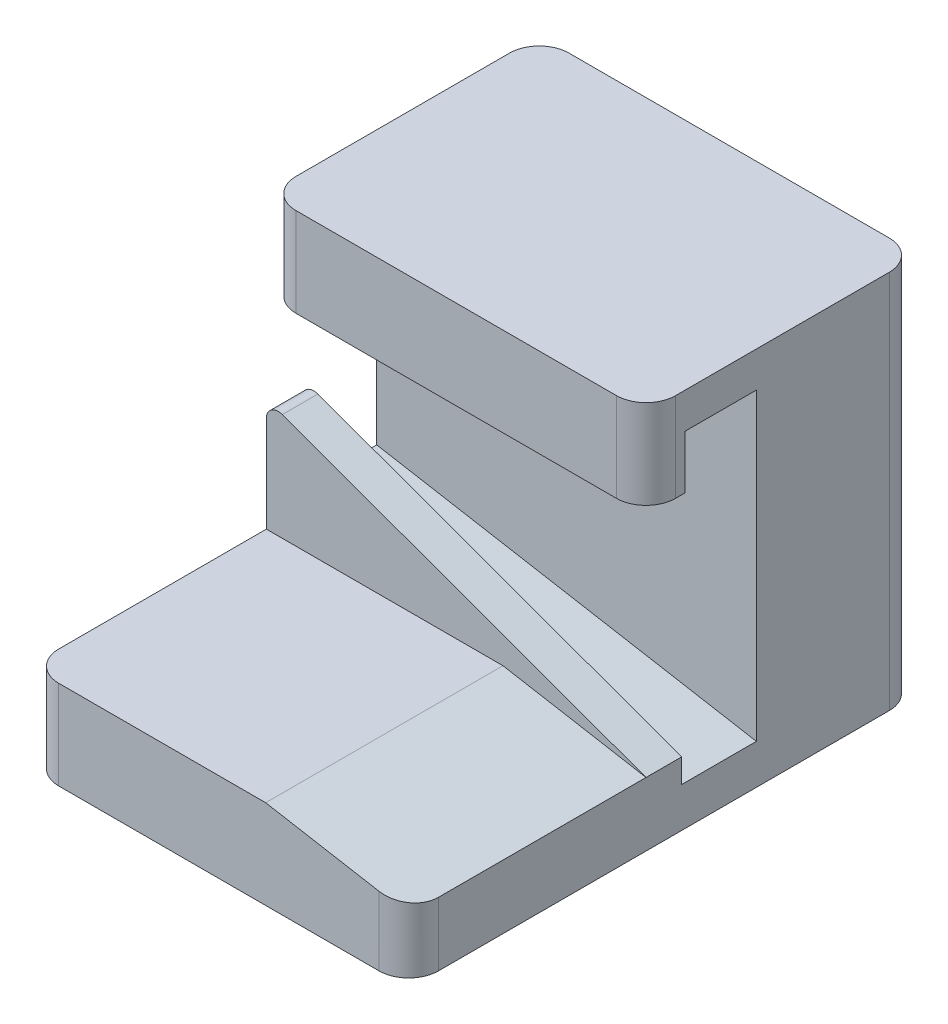
ISO-10303-21;
HEADER;
FILE_DESCRIPTION(('STEP AP214'),'2;1');
FILE_NAME('part.step','',(''),(''),'','','');
FILE_SCHEMA(('AUTOMOTIVE_DESIGN { 1 0 10303 214 1 1 1 1 }'));
ENDSEC;
DATA;
#1=APPLICATION_CONTEXT('core data for automotive mechanical design processes');
#2=APPLICATION_PROTOCOL_DEFINITION('international standard','automotive_design',2000,#1);
#3=PRODUCT_CONTEXT('',#1,'mechanical');
#4=PRODUCT('Part','Part','',(#3));
#5=PRODUCT_RELATED_PRODUCT_CATEGORY('part','',(#4));
#6=PRODUCT_DEFINITION_FORMATION('','',#4);
#7=PRODUCT_DEFINITION_CONTEXT('part definition',#1,'design');
#8=PRODUCT_DEFINITION('design','',#6,#7);
#9=PRODUCT_DEFINITION_SHAPE('','',#8);
#10=(LENGTH_UNIT() NAMED_UNIT(*) SI_UNIT(.MILLI.,.METRE.));
#11=(NAMED_UNIT(*) PLANE_ANGLE_UNIT() SI_UNIT($,.RADIAN.));
#12=(NAMED_UNIT(*) SI_UNIT($,.STERADIAN.) SOLID_ANGLE_UNIT());
#13=UNCERTAINTY_MEASURE_WITH_UNIT(LENGTH_MEASURE(1.E-05),#10,'distance_accuracy_value','');
#14=(GEOMETRIC_REPRESENTATION_CONTEXT(3) GLOBAL_UNCERTAINTY_ASSIGNED_CONTEXT((#13)) GLOBAL_UNIT_ASSIGNED_CONTEXT((#10,
#11,#12)) REPRESENTATION_CONTEXT('',''));
#15=CARTESIAN_POINT('',(0.,0.,0.));
#16=DIRECTION('',(0.,0.,1.));
#17=DIRECTION('',(1.,0.,0.));
#18=AXIS2_PLACEMENT_3D('',#15,#16,#17);
#19=CARTESIAN_POINT('',(-78.74,39.6048925275896,-58.42));
#20=DIRECTION('',(0.,0.,-1.));
#21=DIRECTION('',(-1.,0.,0.));
#22=AXIS2_PLACEMENT_3D('',#19,#20,#21);
#23=CYLINDRICAL_SURFACE('',#22,2.54);
#24=CARTESIAN_POINT('',(-78.74,39.6048925275896,-58.42));
#25=DIRECTION('',(0.,0.,1.));
#26=DIRECTION('',(1.,0.,0.));
#27=AXIS2_PLACEMENT_3D('',#24,#25,#26);
#28=CIRCLE('',#27,2.54);
#29=CARTESIAN_POINT('',(-81.28,39.6048925275896,-58.42));
#30=VERTEX_POINT('',#29);
#31=CARTESIAN_POINT('',(-77.8712688359528,41.9917117843858,-58.42));
#32=VERTEX_POINT('',#31);
#33=EDGE_CURVE('E286',#30,#32,#28,.F.);
#34=ORIENTED_EDGE('',*,*,#33,.F.);
#35=DIRECTION('',(0.,0.,1.));
#36=VECTOR('',#35,1.);
#37=CARTESIAN_POINT('',(-81.28,39.6048925275896,-58.42));
#38=LINE('',#37,#36);
#39=CARTESIAN_POINT('',(-81.28,39.6048925275896,-50.8));
#40=VERTEX_POINT('',#39);
#41=EDGE_CURVE('E296',#40,#30,#38,.F.);
#42=ORIENTED_EDGE('',*,*,#41,.F.);
#43=CARTESIAN_POINT('',(-78.74,39.6048925275896,-50.8));
#44=DIRECTION('',(0.,0.,-1.));
#45=DIRECTION('',(-1.,0.,0.));
#46=AXIS2_PLACEMENT_3D('',#43,#44,#45);
#47=CIRCLE('',#46,2.54);
#48=CARTESIAN_POINT('',(-77.8712688359528,41.9917117843858,-50.8));
#49=VERTEX_POINT('',#48);
#50=EDGE_CURVE('E298',#49,#40,#47,.F.);
#51=ORIENTED_EDGE('',*,*,#50,.F.);
#52=DIRECTION('',(0.,0.,1.));
#53=VECTOR('',#52,1.);
#54=CARTESIAN_POINT('',(-77.8712688359528,41.9917117843858,-58.42));
#55=LINE('',#54,#53);
#56=EDGE_CURVE('E293',#32,#49,#55,.T.);
#57=ORIENTED_EDGE('',*,*,#56,.F.);
#58=EDGE_LOOP('',(#34,#42,#51,#57));
#59=FACE_BOUND('',#58,.T.);
#60=ADVANCED_FACE('F33',(#59),#23,.T.);
#61=CARTESIAN_POINT('',(0.,0.,0.));
#62=DIRECTION('',(-1.,0.,0.));
#63=DIRECTION('',(0.,0.,1.));
#64=AXIS2_PLACEMENT_3D('',#61,#62,#63);
#65=PLANE('',#64);
#66=DIRECTION('',(0.,0.,-1.));
#67=VECTOR('',#66,1.);
#68=CARTESIAN_POINT('',(0.,0.,0.));
#69=LINE('',#68,#67);
#70=CARTESIAN_POINT('',(0.,0.,-6.35));
#71=VERTEX_POINT('',#70);
#72=CARTESIAN_POINT('',(0.,0.,-102.87));
#73=VERTEX_POINT('',#72);
#74=EDGE_CURVE('E261',#71,#73,#69,.T.);
#75=ORIENTED_EDGE('',*,*,#74,.T.);
#76=DIRECTION('',(0.,1.,0.));
#77=VECTOR('',#76,1.);
#78=CARTESIAN_POINT('',(0.,81.28,-102.87));
#79=LINE('',#78,#77);
#80=CARTESIAN_POINT('',(0.,81.28,-102.87));
#81=VERTEX_POINT('',#80);
#82=EDGE_CURVE('E41',#73,#81,#79,.T.);
#83=ORIENTED_EDGE('',*,*,#82,.T.);
#84=DIRECTION('',(0.,0.,1.));
#85=VECTOR('',#84,1.);
#86=CARTESIAN_POINT('',(0.,81.28,0.));
#87=LINE('',#86,#85);
#88=CARTESIAN_POINT('',(0.,81.28,-57.15));
#89=VERTEX_POINT('',#88);
#90=EDGE_CURVE('E276',#81,#89,#87,.T.);
#91=ORIENTED_EDGE('',*,*,#90,.T.);
#92=DIRECTION('',(0.,1.,0.));
#93=VECTOR('',#92,1.);
#94=CARTESIAN_POINT('',(0.,0.,-57.15));
#95=LINE('',#94,#93);
#96=CARTESIAN_POINT('',(0.,62.23,-57.15));
#97=VERTEX_POINT('',#96);
#98=EDGE_CURVE('E346',#89,#97,#95,.F.);
#99=ORIENTED_EDGE('',*,*,#98,.T.);
#100=DIRECTION('',(0.,0.,1.));
#101=VECTOR('',#100,1.);
#102=CARTESIAN_POINT('',(0.,62.23,-50.8));
#103=LINE('',#102,#101);
#104=CARTESIAN_POINT('',(0.,62.23,-59.182));
#105=VERTEX_POINT('',#104);
#106=EDGE_CURVE('E256',#105,#97,#103,.T.);
#107=ORIENTED_EDGE('',*,*,#106,.F.);
#108=DIRECTION('',(0.,-1.,0.));
#109=VECTOR('',#108,1.);
#110=CARTESIAN_POINT('',(0.,0.,-59.182));
#111=LINE('',#110,#109);
#112=CARTESIAN_POINT('',(0.,73.66,-59.182));
#113=VERTEX_POINT('',#112);
#114=EDGE_CURVE('E212',#113,#105,#111,.T.);
#115=ORIENTED_EDGE('',*,*,#114,.F.);
#116=DIRECTION('',(0.,0.,-1.));
#117=VECTOR('',#116,1.);
#118=CARTESIAN_POINT('',(0.,73.66,0.));
#119=LINE('',#118,#117);
#120=CARTESIAN_POINT('',(0.,73.66,-74.422));
#121=VERTEX_POINT('',#120);
#122=EDGE_CURVE('E216',#113,#121,#119,.T.);
#123=ORIENTED_EDGE('',*,*,#122,.T.);
#124=DIRECTION('',(0.,-1.,0.));
#125=VECTOR('',#124,1.);
#126=CARTESIAN_POINT('',(0.,0.,-74.422));
#127=LINE('',#126,#125);
#128=CARTESIAN_POINT('',(0.,8.52814300801657,-74.422));
#129=VERTEX_POINT('',#128);
#130=EDGE_CURVE('E207',#121,#129,#127,.T.);
#131=ORIENTED_EDGE('',*,*,#130,.T.);
#132=DIRECTION('',(0.,0.,-1.));
#133=VECTOR('',#132,1.);
#134=CARTESIAN_POINT('',(0.,8.52814300801657,24.1138750140733));
#135=LINE('',#134,#133);
#136=CARTESIAN_POINT('',(0.,8.52814300801657,-58.42));
#137=VERTEX_POINT('',#136);
#138=EDGE_CURVE('E198',#137,#129,#135,.T.);
#139=ORIENTED_EDGE('',*,*,#138,.F.);
#140=DIRECTION('',(0.,1.,0.));
#141=VECTOR('',#140,1.);
#142=CARTESIAN_POINT('',(0.,8.52814300801657,-58.42));
#143=LINE('',#142,#141);
#144=CARTESIAN_POINT('',(0.,13.6488878235582,-58.42));
#145=VERTEX_POINT('',#144);
#146=EDGE_CURVE('E180',#137,#145,#143,.T.);
#147=ORIENTED_EDGE('',*,*,#146,.T.);
#148=DIRECTION('',(0.,0.,1.));
#149=VECTOR('',#148,1.);
#150=CARTESIAN_POINT('',(0.,13.6488878235582,-58.42));
#151=LINE('',#150,#149);
#152=CARTESIAN_POINT('',(0.,13.6488878235582,-50.8));
#153=VERTEX_POINT('',#152);
#154=EDGE_CURVE('E243',#145,#153,#151,.T.);
#155=ORIENTED_EDGE('',*,*,#154,.T.);
#156=DIRECTION('',(0.,0.,1.));
#157=VECTOR('',#156,1.);
#158=CARTESIAN_POINT('',(0.,13.6488878235582,-50.8));
#159=LINE('',#158,#157);
#160=CARTESIAN_POINT('',(0.,13.6488878235582,-6.35));
#161=VERTEX_POINT('',#160);
#162=EDGE_CURVE('E259',#153,#161,#159,.T.);
#163=ORIENTED_EDGE('',*,*,#162,.T.);
#164=DIRECTION('',(0.,-1.,0.));
#165=VECTOR('',#164,1.);
#166=CARTESIAN_POINT('',(0.,0.,-6.35));
#167=LINE('',#166,#165);
#168=EDGE_CURVE('E343',#161,#71,#167,.T.);
#169=ORIENTED_EDGE('',*,*,#168,.T.);
#170=EDGE_LOOP('',(#75,#83,#91,#99,#107,#115,#123,#131,#139,#147,#155,#163,#169));
#171=FACE_BOUND('',#170,.T.);
#172=ADVANCED_FACE('F204',(#171),#65,.F.);
#173=CARTESIAN_POINT('',(-81.28,0.,0.));
#174=DIRECTION('',(-1.,0.,0.));
#175=DIRECTION('',(0.,0.,1.));
#176=AXIS2_PLACEMENT_3D('',#173,#174,#175);
#177=PLANE('',#176);
#178=DIRECTION('',(0.,0.,1.));
#179=VECTOR('',#178,1.);
#180=CARTESIAN_POINT('',(-81.28,81.28,0.));
#181=LINE('',#180,#179);
#182=CARTESIAN_POINT('',(-81.28,81.28,-102.87));
#183=VERTEX_POINT('',#182);
#184=CARTESIAN_POINT('',(-81.28,81.28,-57.15));
#185=VERTEX_POINT('',#184);
#186=EDGE_CURVE('E275',#183,#185,#181,.T.);
#187=ORIENTED_EDGE('',*,*,#186,.F.);
#188=DIRECTION('',(0.,1.,0.));
#189=VECTOR('',#188,1.);
#190=CARTESIAN_POINT('',(-81.28,0.,-102.87));
#191=LINE('',#190,#189);
#192=CARTESIAN_POINT('',(-81.28,0.,-102.87));
#193=VERTEX_POINT('',#192);
#194=EDGE_CURVE('E318',#183,#193,#191,.F.);
#195=ORIENTED_EDGE('',*,*,#194,.T.);
#196=DIRECTION('',(0.,0.,-1.));
#197=VECTOR('',#196,1.);
#198=CARTESIAN_POINT('',(-81.28,0.,0.));
#199=LINE('',#198,#197);
#200=CARTESIAN_POINT('',(-81.28,0.,-6.35));
#201=VERTEX_POINT('',#200);
#202=EDGE_CURVE('E272',#201,#193,#199,.T.);
#203=ORIENTED_EDGE('',*,*,#202,.F.);
#204=DIRECTION('',(0.,-1.,0.));
#205=VECTOR('',#204,1.);
#206=CARTESIAN_POINT('',(-81.28,0.,-6.35));
#207=LINE('',#206,#205);
#208=CARTESIAN_POINT('',(-81.28,19.05,-6.35));
#209=VERTEX_POINT('',#208);
#210=EDGE_CURVE('E313',#201,#209,#207,.F.);
#211=ORIENTED_EDGE('',*,*,#210,.T.);
#212=DIRECTION('',(0.,0.,1.));
#213=VECTOR('',#212,1.);
#214=CARTESIAN_POINT('',(-81.28,19.05,-50.8));
#215=LINE('',#214,#213);
#216=CARTESIAN_POINT('',(-81.28,19.05,-50.8));
#217=VERTEX_POINT('',#216);
#218=EDGE_CURVE('E265',#217,#209,#215,.T.);
#219=ORIENTED_EDGE('',*,*,#218,.F.);
#220=DIRECTION('',(0.,-1.,0.));
#221=VECTOR('',#220,1.);
#222=CARTESIAN_POINT('',(-81.28,62.23,-50.8));
#223=LINE('',#222,#221);
#224=EDGE_CURVE('E247',#40,#217,#223,.T.);
#225=ORIENTED_EDGE('',*,*,#224,.F.);
#226=ORIENTED_EDGE('',*,*,#41,.T.);
#227=DIRECTION('',(0.,-1.,0.));
#228=VECTOR('',#227,1.);
#229=CARTESIAN_POINT('',(-81.28,0.,-58.42));
#230=LINE('',#229,#228);
#231=CARTESIAN_POINT('',(-81.28,22.86,-58.42));
#232=VERTEX_POINT('',#231);
#233=EDGE_CURVE('E223',#30,#232,#230,.T.);
#234=ORIENTED_EDGE('',*,*,#233,.T.);
#235=DIRECTION('',(0.,0.,-1.));
#236=VECTOR('',#235,1.);
#237=CARTESIAN_POINT('',(-81.28,22.86,0.));
#238=LINE('',#237,#236);
#239=CARTESIAN_POINT('',(-81.28,22.86,-74.422));
#240=VERTEX_POINT('',#239);
#241=EDGE_CURVE('E201',#232,#240,#238,.T.);
#242=ORIENTED_EDGE('',*,*,#241,.T.);
#243=DIRECTION('',(0.,-1.,0.));
#244=VECTOR('',#243,1.);
#245=CARTESIAN_POINT('',(-81.28,0.,-74.422));
#246=LINE('',#245,#244);
#247=CARTESIAN_POINT('',(-81.28,73.66,-74.422));
#248=VERTEX_POINT('',#247);
#249=EDGE_CURVE('E215',#248,#240,#246,.T.);
#250=ORIENTED_EDGE('',*,*,#249,.F.);
#251=DIRECTION('',(0.,0.,-1.));
#252=VECTOR('',#251,1.);
#253=CARTESIAN_POINT('',(-81.28,73.66,0.));
#254=LINE('',#253,#252);
#255=CARTESIAN_POINT('',(-81.28,73.66,-59.182));
#256=VERTEX_POINT('',#255);
#257=EDGE_CURVE('E192',#256,#248,#254,.T.);
#258=ORIENTED_EDGE('',*,*,#257,.F.);
#259=DIRECTION('',(0.,-1.,0.));
#260=VECTOR('',#259,1.);
#261=CARTESIAN_POINT('',(-81.28,0.,-59.182));
#262=LINE('',#261,#260);
#263=CARTESIAN_POINT('',(-81.28,62.23,-59.182));
#264=VERTEX_POINT('',#263);
#265=EDGE_CURVE('E218',#256,#264,#262,.T.);
#266=ORIENTED_EDGE('',*,*,#265,.T.);
#267=DIRECTION('',(0.,0.,1.));
#268=VECTOR('',#267,1.);
#269=CARTESIAN_POINT('',(-81.28,62.23,-50.8));
#270=LINE('',#269,#268);
#271=CARTESIAN_POINT('',(-81.28,62.23,-57.15));
#272=VERTEX_POINT('',#271);
#273=EDGE_CURVE('E267',#264,#272,#270,.T.);
#274=ORIENTED_EDGE('',*,*,#273,.T.);
#275=DIRECTION('',(0.,1.,0.));
#276=VECTOR('',#275,1.);
#277=CARTESIAN_POINT('',(-81.28,81.28,-57.15));
#278=LINE('',#277,#276);
#279=EDGE_CURVE('E315',#272,#185,#278,.T.);
#280=ORIENTED_EDGE('',*,*,#279,.T.);
#281=EDGE_LOOP('',(#187,#195,#203,#211,#219,#225,#226,#234,#242,#250,#258,#266,#274,#280));
#282=FACE_BOUND('',#281,.T.);
#283=ADVANCED_FACE('F374',(#282),#177,.T.);
#284=CARTESIAN_POINT('',(-81.28,0.,0.));
#285=DIRECTION('',(0.,0.,1.));
#286=DIRECTION('',(1.,0.,0.));
#287=AXIS2_PLACEMENT_3D('',#284,#285,#286);
#288=PLANE('',#287);
#289=DIRECTION('',(1.,0.,0.));
#290=VECTOR('',#289,1.);
#291=CARTESIAN_POINT('',(-30.63122929197,19.05,0.));
#292=LINE('',#291,#290);
#293=CARTESIAN_POINT('',(-74.93,19.05,0.));
#294=VERTEX_POINT('',#293);
#295=CARTESIAN_POINT('',(-30.63122929197,19.05,0.));
#296=VERTEX_POINT('',#295);
#297=EDGE_CURVE('E246',#294,#296,#292,.T.);
#298=ORIENTED_EDGE('',*,*,#297,.F.);
#299=DIRECTION('',(0.,-1.,0.));
#300=VECTOR('',#299,1.);
#301=CARTESIAN_POINT('',(-74.93,0.,0.));
#302=LINE('',#301,#300);
#303=CARTESIAN_POINT('',(-74.93,0.,0.));
#304=VERTEX_POINT('',#303);
#305=EDGE_CURVE('E339',#294,#304,#302,.T.);
#306=ORIENTED_EDGE('',*,*,#305,.T.);
#307=DIRECTION('',(1.,0.,0.));
#308=VECTOR('',#307,1.);
#309=CARTESIAN_POINT('',(-81.28,0.,0.));
#310=LINE('',#309,#308);
#311=CARTESIAN_POINT('',(-6.34999999999999,0.,0.));
#312=VERTEX_POINT('',#311);
#313=EDGE_CURVE('E279',#304,#312,#310,.T.);
#314=ORIENTED_EDGE('',*,*,#313,.T.);
#315=DIRECTION('',(0.,-1.,0.));
#316=VECTOR('',#315,1.);
#317=CARTESIAN_POINT('',(-6.35,13.6488878235582,0.));
#318=LINE('',#317,#316);
#319=CARTESIAN_POINT('',(-6.35,14.768564151057,0.));
#320=VERTEX_POINT('',#319);
#321=EDGE_CURVE('E337',#312,#320,#318,.F.);
#322=ORIENTED_EDGE('',*,*,#321,.T.);
#323=DIRECTION('',(0.984807753012208,-0.173648177666931,0.));
#324=VECTOR('',#323,1.);
#325=CARTESIAN_POINT('',(0.,13.6488878235582,0.));
#326=LINE('',#325,#324);
#327=EDGE_CURVE('E250',#296,#320,#326,.T.);
#328=ORIENTED_EDGE('',*,*,#327,.F.);
#329=EDGE_LOOP('',(#298,#306,#314,#322,#328));
#330=FACE_BOUND('',#329,.T.);
#331=ADVANCED_FACE('F406',(#330),#288,.T.);
#332=CARTESIAN_POINT('',(-81.28,81.28,0.));
#333=DIRECTION('',(0.,1.,0.));
#334=DIRECTION('',(0.,0.,1.));
#335=AXIS2_PLACEMENT_3D('',#332,#333,#334);
#336=PLANE('',#335);
#337=DIRECTION('',(1.,0.,0.));
#338=VECTOR('',#337,1.);
#339=CARTESIAN_POINT('',(-81.28,81.28,-109.22));
#340=LINE('',#339,#338);
#341=CARTESIAN_POINT('',(-74.93,81.28,-109.22));
#342=VERTEX_POINT('',#341);
#343=CARTESIAN_POINT('',(-6.34999999999999,81.28,-109.22));
#344=VERTEX_POINT('',#343);
#345=EDGE_CURVE('E283',#342,#344,#340,.T.);
#346=ORIENTED_EDGE('',*,*,#345,.F.);
#347=CARTESIAN_POINT('',(-74.93,81.28,-102.87));
#348=DIRECTION('',(0.,1.,0.));
#349=DIRECTION('',(0.,0.,1.));
#350=AXIS2_PLACEMENT_3D('',#347,#348,#349);
#351=CIRCLE('',#350,6.35);
#352=EDGE_CURVE('E311',#342,#183,#351,.T.);
#353=ORIENTED_EDGE('',*,*,#352,.T.);
#354=ORIENTED_EDGE('',*,*,#186,.T.);
#355=CARTESIAN_POINT('',(-74.93,81.28,-57.15));
#356=DIRECTION('',(0.,1.,0.));
#357=DIRECTION('',(0.,0.,1.));
#358=AXIS2_PLACEMENT_3D('',#355,#356,#357);
#359=CIRCLE('',#358,6.35);
#360=CARTESIAN_POINT('',(-74.93,81.28,-50.8));
#361=VERTEX_POINT('',#360);
#362=EDGE_CURVE('E309',#185,#361,#359,.T.);
#363=ORIENTED_EDGE('',*,*,#362,.T.);
#364=DIRECTION('',(-1.,0.,0.));
#365=VECTOR('',#364,1.);
#366=CARTESIAN_POINT('',(-81.28,81.28,-50.8));
#367=LINE('',#366,#365);
#368=CARTESIAN_POINT('',(-6.34999999999999,81.28,-50.8));
#369=VERTEX_POINT('',#368);
#370=EDGE_CURVE('E225',#369,#361,#367,.T.);
#371=ORIENTED_EDGE('',*,*,#370,.F.);
#372=CARTESIAN_POINT('',(-6.34999999999999,81.28,-57.15));
#373=DIRECTION('',(0.,1.,0.));
#374=DIRECTION('',(0.,0.,1.));
#375=AXIS2_PLACEMENT_3D('',#372,#373,#374);
#376=CIRCLE('',#375,6.35);
#377=EDGE_CURVE('E305',#369,#89,#376,.T.);
#378=ORIENTED_EDGE('',*,*,#377,.T.);
#379=ORIENTED_EDGE('',*,*,#90,.F.);
#380=CARTESIAN_POINT('',(-6.35,81.28,-102.87));
#381=DIRECTION('',(0.,1.,0.));
#382=DIRECTION('',(0.,0.,1.));
#383=AXIS2_PLACEMENT_3D('',#380,#381,#382);
#384=CIRCLE('',#383,6.35);
#385=EDGE_CURVE('E307',#81,#344,#384,.T.);
#386=ORIENTED_EDGE('',*,*,#385,.T.);
#387=EDGE_LOOP('',(#346,#353,#354,#363,#371,#378,#379,#386));
#388=FACE_BOUND('',#387,.T.);
#389=ADVANCED_FACE('F356',(#388),#336,.T.);
#390=CARTESIAN_POINT('',(-81.28,0.,-109.22));
#391=DIRECTION('',(0.,0.,-1.));
#392=DIRECTION('',(-1.,0.,0.));
#393=AXIS2_PLACEMENT_3D('',#390,#391,#392);
#394=PLANE('',#393);
#395=DIRECTION('',(1.,0.,0.));
#396=VECTOR('',#395,1.);
#397=CARTESIAN_POINT('',(-81.28,0.,-109.22));
#398=LINE('',#397,#396);
#399=CARTESIAN_POINT('',(-74.93,0.,-109.22));
#400=VERTEX_POINT('',#399);
#401=CARTESIAN_POINT('',(-6.34999999999999,0.,-109.22));
#402=VERTEX_POINT('',#401);
#403=EDGE_CURVE('E287',#400,#402,#398,.T.);
#404=ORIENTED_EDGE('',*,*,#403,.F.);
#405=DIRECTION('',(0.,1.,0.));
#406=VECTOR('',#405,1.);
#407=CARTESIAN_POINT('',(-74.93,0.,-109.22));
#408=LINE('',#407,#406);
#409=EDGE_CURVE('E302',#400,#342,#408,.T.);
#410=ORIENTED_EDGE('',*,*,#409,.T.);
#411=ORIENTED_EDGE('',*,*,#345,.T.);
#412=DIRECTION('',(0.,1.,0.));
#413=VECTOR('',#412,1.);
#414=CARTESIAN_POINT('',(-6.35,0.,-109.22));
#415=LINE('',#414,#413);
#416=EDGE_CURVE('E300',#344,#402,#415,.F.);
#417=ORIENTED_EDGE('',*,*,#416,.T.);
#418=EDGE_LOOP('',(#404,#410,#411,#417));
#419=FACE_BOUND('',#418,.T.);
#420=ADVANCED_FACE('F382',(#419),#394,.T.);
#421=CARTESIAN_POINT('',(-81.28,0.,0.));
#422=DIRECTION('',(0.,-1.,0.));
#423=DIRECTION('',(0.,0.,-1.));
#424=AXIS2_PLACEMENT_3D('',#421,#422,#423);
#425=PLANE('',#424);
#426=ORIENTED_EDGE('',*,*,#202,.T.);
#427=CARTESIAN_POINT('',(-74.93,0.,-102.87));
#428=DIRECTION('',(0.,-1.,0.));
#429=DIRECTION('',(0.,0.,-1.));
#430=AXIS2_PLACEMENT_3D('',#427,#428,#429);
#431=CIRCLE('',#430,6.35);
#432=EDGE_CURVE('E326',#193,#400,#431,.T.);
#433=ORIENTED_EDGE('',*,*,#432,.T.);
#434=ORIENTED_EDGE('',*,*,#403,.T.);
#435=CARTESIAN_POINT('',(-6.35,0.,-102.87));
#436=DIRECTION('',(0.,-1.,0.));
#437=DIRECTION('',(0.,0.,-1.));
#438=AXIS2_PLACEMENT_3D('',#435,#436,#437);
#439=CIRCLE('',#438,6.35);
#440=EDGE_CURVE('E322',#402,#73,#439,.T.);
#441=ORIENTED_EDGE('',*,*,#440,.T.);
#442=ORIENTED_EDGE('',*,*,#74,.F.);
#443=CARTESIAN_POINT('',(-6.35,0.,-6.35));
#444=DIRECTION('',(0.,-1.,0.));
#445=DIRECTION('',(0.,0.,-1.));
#446=AXIS2_PLACEMENT_3D('',#443,#444,#445);
#447=CIRCLE('',#446,6.35);
#448=EDGE_CURVE('E320',#71,#312,#447,.T.);
#449=ORIENTED_EDGE('',*,*,#448,.T.);
#450=ORIENTED_EDGE('',*,*,#313,.F.);
#451=CARTESIAN_POINT('',(-74.93,0.,-6.35));
#452=DIRECTION('',(0.,-1.,0.));
#453=DIRECTION('',(0.,0.,-1.));
#454=AXIS2_PLACEMENT_3D('',#451,#452,#453);
#455=CIRCLE('',#454,6.35);
#456=EDGE_CURVE('E324',#304,#201,#455,.T.);
#457=ORIENTED_EDGE('',*,*,#456,.T.);
#458=EDGE_LOOP('',(#426,#433,#434,#441,#442,#449,#450,#457));
#459=FACE_BOUND('',#458,.T.);
#460=ADVANCED_FACE('F385',(#459),#425,.T.);
#461=CARTESIAN_POINT('',(0.,13.6488878235582,-50.8));
#462=DIRECTION('',(-0.173648177666931,-0.984807753012208,0.));
#463=DIRECTION('',(0.984807753012208,-0.173648177666931,0.));
#464=AXIS2_PLACEMENT_3D('',#461,#462,#463);
#465=PLANE('',#464);
#466=ORIENTED_EDGE('',*,*,#327,.T.);
#467=CARTESIAN_POINT('',(-6.35,14.768564151057,-6.35));
#468=DIRECTION('',(-0.173648177666931,-0.984807753012208,0.));
#469=DIRECTION('',(-0.984807753012208,0.173648177666931,0.));
#470=AXIS2_PLACEMENT_3D('',#467,#468,#469);
#471=ELLIPSE('',#470,6.44795898547448,6.35);
#472=EDGE_CURVE('E11',#320,#161,#471,.F.);
#473=ORIENTED_EDGE('',*,*,#472,.T.);
#474=ORIENTED_EDGE('',*,*,#162,.F.);
#475=DIRECTION('',(0.984807753012208,-0.173648177666931,0.));
#476=VECTOR('',#475,1.);
#477=CARTESIAN_POINT('',(0.,13.6488878235582,-50.8));
#478=LINE('',#477,#476);
#479=CARTESIAN_POINT('',(-30.63122929197,19.05,-50.8));
#480=VERTEX_POINT('',#479);
#481=EDGE_CURVE('E253',#480,#153,#478,.T.);
#482=ORIENTED_EDGE('',*,*,#481,.F.);
#483=DIRECTION('',(0.,0.,1.));
#484=VECTOR('',#483,1.);
#485=CARTESIAN_POINT('',(-30.63122929197,19.05,-50.8));
#486=LINE('',#485,#484);
#487=EDGE_CURVE('E262',#480,#296,#486,.T.);
#488=ORIENTED_EDGE('',*,*,#487,.T.);
#489=EDGE_LOOP('',(#466,#473,#474,#482,#488));
#490=FACE_BOUND('',#489,.T.);
#491=ADVANCED_FACE('F458',(#490),#465,.F.);
#492=CARTESIAN_POINT('',(-30.63122929197,19.05,-50.8));
#493=DIRECTION('',(0.,-1.,0.));
#494=DIRECTION('',(1.,0.,0.));
#495=AXIS2_PLACEMENT_3D('',#492,#493,#494);
#496=PLANE('',#495);
#497=ORIENTED_EDGE('',*,*,#218,.T.);
#498=CARTESIAN_POINT('',(-74.93,19.05,-6.35));
#499=DIRECTION('',(0.,-1.,0.));
#500=DIRECTION('',(1.,0.,0.));
#501=AXIS2_PLACEMENT_3D('',#498,#499,#500);
#502=CIRCLE('',#501,6.35);
#503=EDGE_CURVE('E54',#209,#294,#502,.F.);
#504=ORIENTED_EDGE('',*,*,#503,.T.);
#505=ORIENTED_EDGE('',*,*,#297,.T.);
#506=ORIENTED_EDGE('',*,*,#487,.F.);
#507=DIRECTION('',(1.,0.,0.));
#508=VECTOR('',#507,1.);
#509=CARTESIAN_POINT('',(-30.63122929197,19.05,-50.8));
#510=LINE('',#509,#508);
#511=EDGE_CURVE('E249',#217,#480,#510,.T.);
#512=ORIENTED_EDGE('',*,*,#511,.F.);
#513=EDGE_LOOP('',(#497,#504,#505,#506,#512));
#514=FACE_BOUND('',#513,.T.);
#515=ADVANCED_FACE('F453',(#514),#496,.F.);
#516=CARTESIAN_POINT('',(-81.28,62.23,-50.8));
#517=DIRECTION('',(0.,1.,0.));
#518=DIRECTION('',(0.,0.,1.));
#519=AXIS2_PLACEMENT_3D('',#516,#517,#518);
#520=PLANE('',#519);
#521=DIRECTION('',(1.,0.,0.));
#522=VECTOR('',#521,1.);
#523=CARTESIAN_POINT('',(-81.28,62.23,-50.8));
#524=LINE('',#523,#522);
#525=CARTESIAN_POINT('',(-74.93,62.23,-50.8));
#526=VERTEX_POINT('',#525);
#527=CARTESIAN_POINT('',(-6.34999999999999,62.23,-50.8));
#528=VERTEX_POINT('',#527);
#529=EDGE_CURVE('E236',#526,#528,#524,.T.);
#530=ORIENTED_EDGE('',*,*,#529,.F.);
#531=CARTESIAN_POINT('',(-74.93,62.23,-57.15));
#532=DIRECTION('',(0.,1.,0.));
#533=DIRECTION('',(0.,0.,1.));
#534=AXIS2_PLACEMENT_3D('',#531,#532,#533);
#535=CIRCLE('',#534,6.35);
#536=EDGE_CURVE('E335',#526,#272,#535,.F.);
#537=ORIENTED_EDGE('',*,*,#536,.T.);
#538=ORIENTED_EDGE('',*,*,#273,.F.);
#539=DIRECTION('',(1.,0.,0.));
#540=VECTOR('',#539,1.);
#541=CARTESIAN_POINT('',(-134.540717268922,62.23,-59.182));
#542=LINE('',#541,#540);
#543=EDGE_CURVE('E226',#264,#105,#542,.T.);
#544=ORIENTED_EDGE('',*,*,#543,.T.);
#545=ORIENTED_EDGE('',*,*,#106,.T.);
#546=CARTESIAN_POINT('',(-6.34999999999999,62.23,-57.15));
#547=DIRECTION('',(0.,1.,0.));
#548=DIRECTION('',(0.,0.,1.));
#549=AXIS2_PLACEMENT_3D('',#546,#547,#548);
#550=CIRCLE('',#549,6.35);
#551=EDGE_CURVE('E333',#97,#528,#550,.F.);
#552=ORIENTED_EDGE('',*,*,#551,.T.);
#553=EDGE_LOOP('',(#530,#537,#538,#544,#545,#552));
#554=FACE_BOUND('',#553,.T.);
#555=ADVANCED_FACE('F368',(#554),#520,.F.);
#556=CARTESIAN_POINT('',(0.,0.,-50.8));
#557=DIRECTION('',(0.,0.,-1.));
#558=DIRECTION('',(-1.,0.,0.));
#559=AXIS2_PLACEMENT_3D('',#556,#557,#558);
#560=PLANE('',#559);
#561=DIRECTION('',(0.939692620785911,-0.342020143325663,0.));
#562=VECTOR('',#561,1.);
#563=CARTESIAN_POINT('',(0.,13.6488878235582,-50.8));
#564=LINE('',#563,#562);
#565=EDGE_CURVE('E239',#49,#153,#564,.T.);
#566=ORIENTED_EDGE('',*,*,#565,.F.);
#567=ORIENTED_EDGE('',*,*,#50,.T.);
#568=ORIENTED_EDGE('',*,*,#224,.T.);
#569=ORIENTED_EDGE('',*,*,#511,.T.);
#570=ORIENTED_EDGE('',*,*,#481,.T.);
#571=EDGE_LOOP('',(#566,#567,#568,#569,#570));
#572=FACE_BOUND('',#571,.T.);
#573=ADVANCED_FACE('F457',(#572),#560,.F.);
#574=CARTESIAN_POINT('',(0.,13.6488878235582,-58.42));
#575=DIRECTION('',(-0.342020143325663,-0.939692620785911,0.));
#576=DIRECTION('',(0.939692620785911,-0.342020143325663,0.));
#577=AXIS2_PLACEMENT_3D('',#574,#575,#576);
#578=PLANE('',#577);
#579=DIRECTION('',(0.939692620785911,-0.342020143325663,0.));
#580=VECTOR('',#579,1.);
#581=CARTESIAN_POINT('',(0.,13.6488878235582,-58.42));
#582=LINE('',#581,#580);
#583=EDGE_CURVE('E187',#32,#145,#582,.T.);
#584=ORIENTED_EDGE('',*,*,#583,.F.);
#585=ORIENTED_EDGE('',*,*,#56,.T.);
#586=ORIENTED_EDGE('',*,*,#565,.T.);
#587=ORIENTED_EDGE('',*,*,#154,.F.);
#588=EDGE_LOOP('',(#584,#585,#586,#587));
#589=FACE_BOUND('',#588,.T.);
#590=ADVANCED_FACE('F514',(#589),#578,.F.);
#591=CARTESIAN_POINT('',(-81.28,-33.6192483016951,-50.8));
#592=DIRECTION('',(0.,0.,-1.));
#593=DIRECTION('',(-1.,0.,0.));
#594=AXIS2_PLACEMENT_3D('',#591,#592,#593);
#595=PLANE('',#594);
#596=ORIENTED_EDGE('',*,*,#370,.T.);
#597=DIRECTION('',(0.,1.,0.));
#598=VECTOR('',#597,1.);
#599=CARTESIAN_POINT('',(-74.93,62.23,-50.8));
#600=LINE('',#599,#598);
#601=EDGE_CURVE('E331',#361,#526,#600,.F.);
#602=ORIENTED_EDGE('',*,*,#601,.T.);
#603=ORIENTED_EDGE('',*,*,#529,.T.);
#604=DIRECTION('',(0.,1.,0.));
#605=VECTOR('',#604,1.);
#606=CARTESIAN_POINT('',(-6.34999999999999,-33.6192483016951,-50.8));
#607=LINE('',#606,#605);
#608=EDGE_CURVE('E328',#528,#369,#607,.T.);
#609=ORIENTED_EDGE('',*,*,#608,.T.);
#610=EDGE_LOOP('',(#596,#602,#603,#609));
#611=FACE_BOUND('',#610,.T.);
#612=ADVANCED_FACE('F363',(#611),#595,.F.);
#613=CARTESIAN_POINT('',(-134.540717268922,0.,-58.42));
#614=DIRECTION('',(0.,0.,1.));
#615=DIRECTION('',(1.,0.,0.));
#616=AXIS2_PLACEMENT_3D('',#613,#614,#615);
#617=PLANE('',#616);
#618=ORIENTED_EDGE('',*,*,#233,.F.);
#619=ORIENTED_EDGE('',*,*,#33,.T.);
#620=ORIENTED_EDGE('',*,*,#583,.T.);
#621=ORIENTED_EDGE('',*,*,#146,.F.);
#622=DIRECTION('',(0.984807753012209,-0.173648177666923,0.));
#623=VECTOR('',#622,1.);
#624=CARTESIAN_POINT('',(-81.28,22.86,-58.42));
#625=LINE('',#624,#623);
#626=EDGE_CURVE('E184',#232,#137,#625,.T.);
#627=ORIENTED_EDGE('',*,*,#626,.F.);
#628=EDGE_LOOP('',(#618,#619,#620,#621,#627));
#629=FACE_BOUND('',#628,.T.);
#630=ADVANCED_FACE('F183',(#629),#617,.F.);
#631=CARTESIAN_POINT('',(-134.540717268922,0.,-74.422));
#632=DIRECTION('',(0.,0.,1.));
#633=DIRECTION('',(0.,-1.,0.));
#634=AXIS2_PLACEMENT_3D('',#631,#632,#633);
#635=PLANE('',#634);
#636=ORIENTED_EDGE('',*,*,#249,.T.);
#637=DIRECTION('',(0.984807753012209,-0.173648177666923,0.));
#638=VECTOR('',#637,1.);
#639=CARTESIAN_POINT('',(-81.28,22.86,-74.422));
#640=LINE('',#639,#638);
#641=EDGE_CURVE('E208',#240,#129,#640,.T.);
#642=ORIENTED_EDGE('',*,*,#641,.T.);
#643=ORIENTED_EDGE('',*,*,#130,.F.);
#644=DIRECTION('',(1.,0.,0.));
#645=VECTOR('',#644,1.);
#646=CARTESIAN_POINT('',(-134.540717268922,73.66,-74.422));
#647=LINE('',#646,#645);
#648=EDGE_CURVE('E221',#248,#121,#647,.T.);
#649=ORIENTED_EDGE('',*,*,#648,.F.);
#650=EDGE_LOOP('',(#636,#642,#643,#649));
#651=FACE_BOUND('',#650,.T.);
#652=ADVANCED_FACE('F543',(#651),#635,.T.);
#653=CARTESIAN_POINT('',(-134.540717268922,73.66,0.));
#654=DIRECTION('',(0.,-1.,0.));
#655=DIRECTION('',(0.,0.,-1.));
#656=AXIS2_PLACEMENT_3D('',#653,#654,#655);
#657=PLANE('',#656);
#658=ORIENTED_EDGE('',*,*,#257,.T.);
#659=ORIENTED_EDGE('',*,*,#648,.T.);
#660=ORIENTED_EDGE('',*,*,#122,.F.);
#661=DIRECTION('',(1.,0.,0.));
#662=VECTOR('',#661,1.);
#663=CARTESIAN_POINT('',(-134.540717268922,73.66,-59.182));
#664=LINE('',#663,#662);
#665=EDGE_CURVE('E219',#256,#113,#664,.T.);
#666=ORIENTED_EDGE('',*,*,#665,.F.);
#667=EDGE_LOOP('',(#658,#659,#660,#666));
#668=FACE_BOUND('',#667,.T.);
#669=ADVANCED_FACE('F549',(#668),#657,.T.);
#670=CARTESIAN_POINT('',(-134.540717268922,0.,-59.182));
#671=DIRECTION('',(0.,0.,1.));
#672=DIRECTION('',(1.,0.,0.));
#673=AXIS2_PLACEMENT_3D('',#670,#671,#672);
#674=PLANE('',#673);
#675=ORIENTED_EDGE('',*,*,#665,.T.);
#676=ORIENTED_EDGE('',*,*,#114,.T.);
#677=ORIENTED_EDGE('',*,*,#543,.F.);
#678=ORIENTED_EDGE('',*,*,#265,.F.);
#679=EDGE_LOOP('',(#675,#676,#677,#678));
#680=FACE_BOUND('',#679,.T.);
#681=ADVANCED_FACE('F539',(#680),#674,.F.);
#682=CARTESIAN_POINT('',(-81.28,22.86,24.1138750140733));
#683=DIRECTION('',(0.173648177666923,0.984807753012209,0.));
#684=DIRECTION('',(-0.984807753012209,0.173648177666923,0.));
#685=AXIS2_PLACEMENT_3D('',#682,#683,#684);
#686=PLANE('',#685);
#687=ORIENTED_EDGE('',*,*,#626,.T.);
#688=ORIENTED_EDGE('',*,*,#138,.T.);
#689=ORIENTED_EDGE('',*,*,#641,.F.);
#690=ORIENTED_EDGE('',*,*,#241,.F.);
#691=EDGE_LOOP('',(#687,#688,#689,#690));
#692=FACE_BOUND('',#691,.T.);
#693=ADVANCED_FACE('F197',(#692),#686,.T.);
#694=CARTESIAN_POINT('',(-74.93,0.,-102.87));
#695=DIRECTION('',(0.,1.,0.));
#696=DIRECTION('',(0.,0.,1.));
#697=AXIS2_PLACEMENT_3D('',#694,#695,#696);
#698=CYLINDRICAL_SURFACE('',#697,6.35);
#699=ORIENTED_EDGE('',*,*,#432,.F.);
#700=ORIENTED_EDGE('',*,*,#194,.F.);
#701=ORIENTED_EDGE('',*,*,#352,.F.);
#702=ORIENTED_EDGE('',*,*,#409,.F.);
#703=EDGE_LOOP('',(#699,#700,#701,#702));
#704=FACE_BOUND('',#703,.T.);
#705=ADVANCED_FACE('F379',(#704),#698,.T.);
#706=CARTESIAN_POINT('',(-74.93,0.,-57.15));
#707=DIRECTION('',(0.,-1.,0.));
#708=DIRECTION('',(0.,0.,-1.));
#709=AXIS2_PLACEMENT_3D('',#706,#707,#708);
#710=CYLINDRICAL_SURFACE('',#709,6.35);
#711=ORIENTED_EDGE('',*,*,#536,.F.);
#712=ORIENTED_EDGE('',*,*,#601,.F.);
#713=ORIENTED_EDGE('',*,*,#362,.F.);
#714=ORIENTED_EDGE('',*,*,#279,.F.);
#715=EDGE_LOOP('',(#711,#712,#713,#714));
#716=FACE_BOUND('',#715,.T.);
#717=ADVANCED_FACE('F371',(#716),#710,.T.);
#718=CARTESIAN_POINT('',(-74.93,0.,-6.35));
#719=DIRECTION('',(0.,-1.,0.));
#720=DIRECTION('',(0.,0.,-1.));
#721=AXIS2_PLACEMENT_3D('',#718,#719,#720);
#722=CYLINDRICAL_SURFACE('',#721,6.35);
#723=ORIENTED_EDGE('',*,*,#503,.F.);
#724=ORIENTED_EDGE('',*,*,#210,.F.);
#725=ORIENTED_EDGE('',*,*,#456,.F.);
#726=ORIENTED_EDGE('',*,*,#305,.F.);
#727=EDGE_LOOP('',(#723,#724,#725,#726));
#728=FACE_BOUND('',#727,.T.);
#729=ADVANCED_FACE('F388',(#728),#722,.T.);
#730=CARTESIAN_POINT('',(-6.35,0.,-102.87));
#731=DIRECTION('',(0.,-1.,0.));
#732=DIRECTION('',(0.,0.,-1.));
#733=AXIS2_PLACEMENT_3D('',#730,#731,#732);
#734=CYLINDRICAL_SURFACE('',#733,6.35);
#735=ORIENTED_EDGE('',*,*,#440,.F.);
#736=ORIENTED_EDGE('',*,*,#416,.F.);
#737=ORIENTED_EDGE('',*,*,#385,.F.);
#738=ORIENTED_EDGE('',*,*,#82,.F.);
#739=EDGE_LOOP('',(#735,#736,#737,#738));
#740=FACE_BOUND('',#739,.T.);
#741=ADVANCED_FACE('F386',(#740),#734,.T.);
#742=CARTESIAN_POINT('',(-6.34999999999999,-33.6192483016951,-57.15));
#743=DIRECTION('',(0.,1.,0.));
#744=DIRECTION('',(0.,0.,1.));
#745=AXIS2_PLACEMENT_3D('',#742,#743,#744);
#746=CYLINDRICAL_SURFACE('',#745,6.35);
#747=ORIENTED_EDGE('',*,*,#551,.F.);
#748=ORIENTED_EDGE('',*,*,#98,.F.);
#749=ORIENTED_EDGE('',*,*,#377,.F.);
#750=ORIENTED_EDGE('',*,*,#608,.F.);
#751=EDGE_LOOP('',(#747,#748,#749,#750));
#752=FACE_BOUND('',#751,.T.);
#753=ADVANCED_FACE('F361',(#752),#746,.T.);
#754=CARTESIAN_POINT('',(-6.35,0.,-6.35));
#755=DIRECTION('',(0.,1.,0.));
#756=DIRECTION('',(0.,0.,1.));
#757=AXIS2_PLACEMENT_3D('',#754,#755,#756);
#758=CYLINDRICAL_SURFACE('',#757,6.35);
#759=ORIENTED_EDGE('',*,*,#472,.F.);
#760=ORIENTED_EDGE('',*,*,#321,.F.);
#761=ORIENTED_EDGE('',*,*,#448,.F.);
#762=ORIENTED_EDGE('',*,*,#168,.F.);
#763=EDGE_LOOP('',(#759,#760,#761,#762));
#764=FACE_BOUND('',#763,.T.);
#765=ADVANCED_FACE('F35',(#764),#758,.T.);
#766=CLOSED_SHELL('',(#60,#172,#283,#331,#389,#420,#460,#491,#515,#555,#573,#590,#612,#630,#652,
#669,#681,#693,#705,#717,#729,#741,#753,#765));
#767=MANIFOLD_SOLID_BREP('B2',#766);
#768=ADVANCED_BREP_SHAPE_REPRESENTATION('',(#18,#767),#14);
#769=SHAPE_DEFINITION_REPRESENTATION(#9,#768);
ENDSEC;
END-ISO-10303-21;
